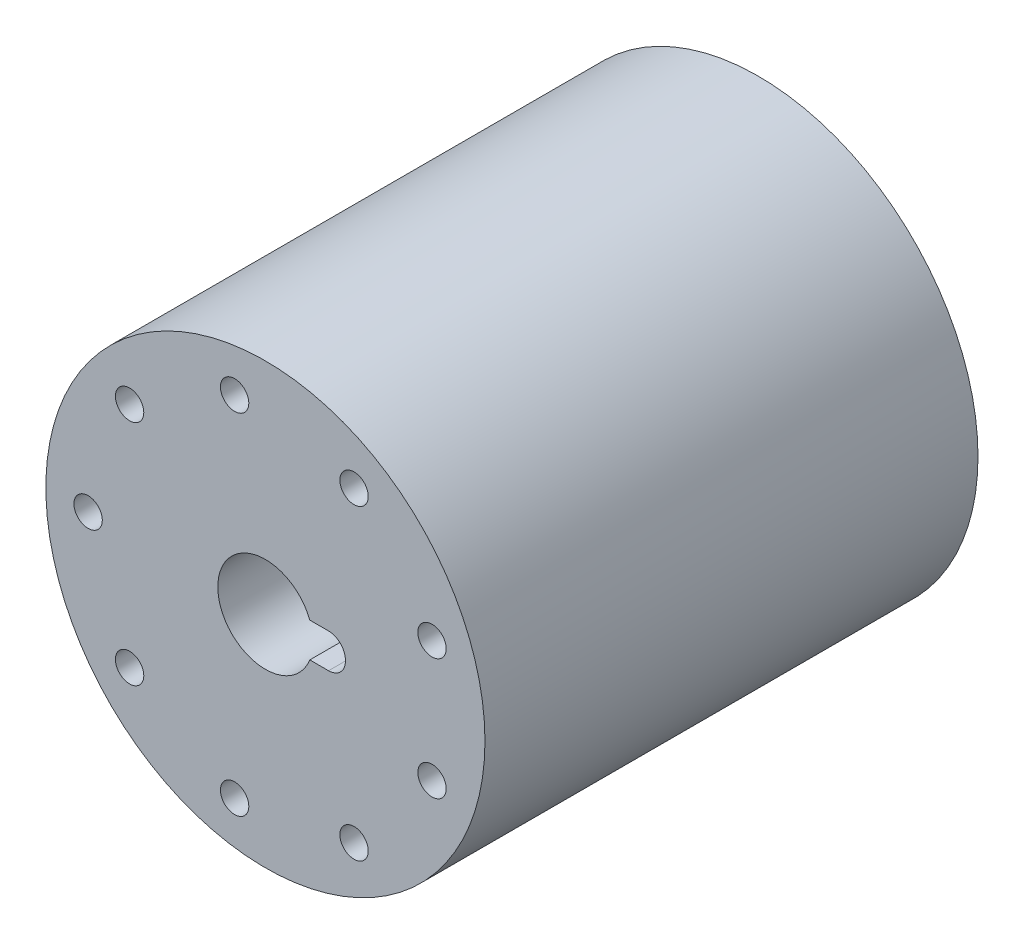
ISO-10303-21;
HEADER;
FILE_DESCRIPTION(('STEP AP214'),'2;1');
FILE_NAME('part.step','',(''),(''),'','','');
FILE_SCHEMA(('AUTOMOTIVE_DESIGN { 1 0 10303 214 1 1 1 1 }'));
ENDSEC;
DATA;
#1=APPLICATION_CONTEXT('core data for automotive mechanical design processes');
#2=APPLICATION_PROTOCOL_DEFINITION('international standard','automotive_design',2000,#1);
#3=PRODUCT_CONTEXT('',#1,'mechanical');
#4=PRODUCT('Part','Part','',(#3));
#5=PRODUCT_RELATED_PRODUCT_CATEGORY('part','',(#4));
#6=PRODUCT_DEFINITION_FORMATION('','',#4);
#7=PRODUCT_DEFINITION_CONTEXT('part definition',#1,'design');
#8=PRODUCT_DEFINITION('design','',#6,#7);
#9=PRODUCT_DEFINITION_SHAPE('','',#8);
#10=(LENGTH_UNIT() NAMED_UNIT(*) SI_UNIT(.MILLI.,.METRE.));
#11=(NAMED_UNIT(*) PLANE_ANGLE_UNIT() SI_UNIT($,.RADIAN.));
#12=(NAMED_UNIT(*) SI_UNIT($,.STERADIAN.) SOLID_ANGLE_UNIT());
#13=UNCERTAINTY_MEASURE_WITH_UNIT(LENGTH_MEASURE(1.E-05),#10,'distance_accuracy_value','');
#14=(GEOMETRIC_REPRESENTATION_CONTEXT(3) GLOBAL_UNCERTAINTY_ASSIGNED_CONTEXT((#13)) GLOBAL_UNIT_ASSIGNED_CONTEXT((#10,
#11,#12)) REPRESENTATION_CONTEXT('',''));
#15=CARTESIAN_POINT('',(0.,0.,0.));
#16=DIRECTION('',(0.,0.,1.));
#17=DIRECTION('',(1.,0.,0.));
#18=AXIS2_PLACEMENT_3D('',#15,#16,#17);
#19=CARTESIAN_POINT('',(0.,0.,26.5));
#20=DIRECTION('',(0.,0.,1.));
#21=DIRECTION('',(1.,0.,0.));
#22=AXIS2_PLACEMENT_3D('',#19,#20,#21);
#23=PLANE('',#22);
#24=DIRECTION('',(-1.,0.,0.));
#25=VECTOR('',#24,1.);
#26=CARTESIAN_POINT('',(7.961335345031,2.55,26.5));
#27=LINE('',#26,#25);
#28=CARTESIAN_POINT('',(9.35,2.55,26.5));
#29=VERTEX_POINT('',#28);
#30=CARTESIAN_POINT('',(6.572670690062,2.55,26.5));
#31=VERTEX_POINT('',#30);
#32=EDGE_CURVE('E247',#29,#31,#27,.T.);
#33=ORIENTED_EDGE('',*,*,#32,.T.);
#34=CARTESIAN_POINT('',(0.,0.,26.5));
#35=DIRECTION('',(0.,0.,1.));
#36=DIRECTION('',(1.,0.,0.));
#37=AXIS2_PLACEMENT_3D('',#34,#35,#36);
#38=CIRCLE('',#37,7.05);
#39=CARTESIAN_POINT('',(6.572670690062,-2.55,26.5));
#40=VERTEX_POINT('',#39);
#41=EDGE_CURVE('E234',#31,#40,#38,.T.);
#42=ORIENTED_EDGE('',*,*,#41,.T.);
#43=DIRECTION('',(-1.,0.,0.));
#44=VECTOR('',#43,1.);
#45=CARTESIAN_POINT('',(7.961335345031,-2.55,26.5));
#46=LINE('',#45,#44);
#47=CARTESIAN_POINT('',(9.35,-2.55,26.5));
#48=VERTEX_POINT('',#47);
#49=EDGE_CURVE('E382',#48,#40,#46,.T.);
#50=ORIENTED_EDGE('',*,*,#49,.F.);
#51=CARTESIAN_POINT('',(9.35,-0.0499999999999974,26.5));
#52=DIRECTION('',(0.,0.,-1.));
#53=DIRECTION('',(1.,0.,0.));
#54=AXIS2_PLACEMENT_3D('',#51,#52,#53);
#55=CIRCLE('',#54,2.5);
#56=CARTESIAN_POINT('',(11.85,-0.0499999999999945,26.5));
#57=VERTEX_POINT('',#56);
#58=EDGE_CURVE('E293',#57,#48,#55,.T.);
#59=ORIENTED_EDGE('',*,*,#58,.F.);
#60=DIRECTION('',(0.,1.,0.));
#61=VECTOR('',#60,1.);
#62=CARTESIAN_POINT('',(11.85,-0.0249999999999973,26.5));
#63=LINE('',#62,#61);
#64=CARTESIAN_POINT('',(11.85,0.0499999999999944,26.5));
#65=VERTEX_POINT('',#64);
#66=EDGE_CURVE('E27',#57,#65,#63,.T.);
#67=ORIENTED_EDGE('',*,*,#66,.T.);
#68=CARTESIAN_POINT('',(9.35,0.0499999999999974,26.5));
#69=DIRECTION('',(0.,0.,1.));
#70=DIRECTION('',(1.,0.,0.));
#71=AXIS2_PLACEMENT_3D('',#68,#69,#70);
#72=CIRCLE('',#71,2.5);
#73=EDGE_CURVE('E11',#65,#29,#72,.T.);
#74=ORIENTED_EDGE('',*,*,#73,.T.);
#75=EDGE_LOOP('',(#33,#42,#50,#59,#67,#74));
#76=FACE_BOUND('',#75,.T.);
#77=ADVANCED_FACE('F16',(#76),#23,.T.);
#78=CARTESIAN_POINT('',(9.35,0.0499999999999974,26.5));
#79=DIRECTION('',(0.,0.,1.));
#80=DIRECTION('',(1.,0.,0.));
#81=AXIS2_PLACEMENT_3D('',#78,#79,#80);
#82=CYLINDRICAL_SURFACE('',#81,2.5);
#83=CARTESIAN_POINT('',(9.35,0.0499999999999974,36.5));
#84=DIRECTION('',(0.,0.,1.));
#85=DIRECTION('',(1.,0.,0.));
#86=AXIS2_PLACEMENT_3D('',#83,#84,#85);
#87=CIRCLE('',#86,2.5);
#88=CARTESIAN_POINT('',(11.85,0.0499999999999974,36.5));
#89=VERTEX_POINT('',#88);
#90=CARTESIAN_POINT('',(9.35,2.55,36.5));
#91=VERTEX_POINT('',#90);
#92=EDGE_CURVE('E303',#89,#91,#87,.T.);
#93=ORIENTED_EDGE('',*,*,#92,.T.);
#94=DIRECTION('',(0.,0.,1.));
#95=VECTOR('',#94,1.);
#96=CARTESIAN_POINT('',(9.35,2.55,26.5));
#97=LINE('',#96,#95);
#98=EDGE_CURVE('E250',#29,#91,#97,.T.);
#99=ORIENTED_EDGE('',*,*,#98,.F.);
#100=ORIENTED_EDGE('',*,*,#73,.F.);
#101=DIRECTION('',(0.,0.,1.));
#102=VECTOR('',#101,1.);
#103=CARTESIAN_POINT('',(11.85,0.0499999999999944,26.5));
#104=LINE('',#103,#102);
#105=EDGE_CURVE('E291',#65,#89,#104,.T.);
#106=ORIENTED_EDGE('',*,*,#105,.T.);
#107=EDGE_LOOP('',(#93,#99,#100,#106));
#108=FACE_BOUND('',#107,.T.);
#109=ADVANCED_FACE('F425',(#108),#82,.F.);
#110=CARTESIAN_POINT('',(11.85,-0.0249999999999973,26.5));
#111=DIRECTION('',(1.,0.,0.));
#112=DIRECTION('',(0.,1.,0.));
#113=AXIS2_PLACEMENT_3D('',#110,#111,#112);
#114=PLANE('',#113);
#115=DIRECTION('',(0.,1.,0.));
#116=VECTOR('',#115,1.);
#117=CARTESIAN_POINT('',(11.85,-0.0249999999999973,36.5));
#118=LINE('',#117,#116);
#119=CARTESIAN_POINT('',(11.85,-0.0499999999999945,36.5));
#120=VERTEX_POINT('',#119);
#121=EDGE_CURVE('E307',#120,#89,#118,.T.);
#122=ORIENTED_EDGE('',*,*,#121,.T.);
#123=ORIENTED_EDGE('',*,*,#105,.F.);
#124=ORIENTED_EDGE('',*,*,#66,.F.);
#125=DIRECTION('',(0.,0.,1.));
#126=VECTOR('',#125,1.);
#127=CARTESIAN_POINT('',(11.85,-0.0499999999999945,26.5));
#128=LINE('',#127,#126);
#129=EDGE_CURVE('E354',#57,#120,#128,.T.);
#130=ORIENTED_EDGE('',*,*,#129,.T.);
#131=EDGE_LOOP('',(#122,#123,#124,#130));
#132=FACE_BOUND('',#131,.T.);
#133=ADVANCED_FACE('F423',(#132),#114,.F.);
#134=CARTESIAN_POINT('',(9.35,-0.0499999999999974,26.5));
#135=DIRECTION('',(0.,0.,1.));
#136=DIRECTION('',(1.,0.,0.));
#137=AXIS2_PLACEMENT_3D('',#134,#135,#136);
#138=CYLINDRICAL_SURFACE('',#137,2.5);
#139=CARTESIAN_POINT('',(9.35,-0.0499999999999974,36.5));
#140=DIRECTION('',(0.,0.,-1.));
#141=DIRECTION('',(1.,0.,0.));
#142=AXIS2_PLACEMENT_3D('',#139,#140,#141);
#143=CIRCLE('',#142,2.5);
#144=CARTESIAN_POINT('',(9.35,-2.55,36.5));
#145=VERTEX_POINT('',#144);
#146=EDGE_CURVE('E316',#120,#145,#143,.T.);
#147=ORIENTED_EDGE('',*,*,#146,.F.);
#148=ORIENTED_EDGE('',*,*,#129,.F.);
#149=ORIENTED_EDGE('',*,*,#58,.T.);
#150=DIRECTION('',(0.,0.,1.));
#151=VECTOR('',#150,1.);
#152=CARTESIAN_POINT('',(9.35,-2.55,26.5));
#153=LINE('',#152,#151);
#154=EDGE_CURVE('E244',#48,#145,#153,.T.);
#155=ORIENTED_EDGE('',*,*,#154,.T.);
#156=EDGE_LOOP('',(#147,#148,#149,#155));
#157=FACE_BOUND('',#156,.T.);
#158=ADVANCED_FACE('F419',(#157),#138,.F.);
#159=CARTESIAN_POINT('',(7.961335345031,-2.55,26.5));
#160=DIRECTION('',(0.,1.,0.));
#161=DIRECTION('',(1.,0.,0.));
#162=AXIS2_PLACEMENT_3D('',#159,#160,#161);
#163=PLANE('',#162);
#164=DIRECTION('',(-1.,0.,0.));
#165=VECTOR('',#164,1.);
#166=CARTESIAN_POINT('',(7.961335345031,-2.55,36.5));
#167=LINE('',#166,#165);
#168=CARTESIAN_POINT('',(6.572670690062,-2.55,36.5));
#169=VERTEX_POINT('',#168);
#170=EDGE_CURVE('E302',#145,#169,#167,.T.);
#171=ORIENTED_EDGE('',*,*,#170,.F.);
#172=ORIENTED_EDGE('',*,*,#154,.F.);
#173=ORIENTED_EDGE('',*,*,#49,.T.);
#174=DIRECTION('',(0.,0.,1.));
#175=VECTOR('',#174,1.);
#176=CARTESIAN_POINT('',(6.572670690062,-2.55,26.5));
#177=LINE('',#176,#175);
#178=EDGE_CURVE('E240',#40,#169,#177,.T.);
#179=ORIENTED_EDGE('',*,*,#178,.T.);
#180=EDGE_LOOP('',(#171,#172,#173,#179));
#181=FACE_BOUND('',#180,.T.);
#182=ADVANCED_FACE('F413',(#181),#163,.T.);
#183=CARTESIAN_POINT('',(0.,0.,26.5));
#184=DIRECTION('',(0.,0.,1.));
#185=DIRECTION('',(1.,0.,0.));
#186=AXIS2_PLACEMENT_3D('',#183,#184,#185);
#187=CYLINDRICAL_SURFACE('',#186,7.05);
#188=CARTESIAN_POINT('',(0.,0.,36.5));
#189=DIRECTION('',(0.,0.,1.));
#190=DIRECTION('',(1.,0.,0.));
#191=AXIS2_PLACEMENT_3D('',#188,#189,#190);
#192=CIRCLE('',#191,7.05);
#193=CARTESIAN_POINT('',(6.572670690062,2.55,36.5));
#194=VERTEX_POINT('',#193);
#195=EDGE_CURVE('E299',#194,#169,#192,.T.);
#196=ORIENTED_EDGE('',*,*,#195,.T.);
#197=ORIENTED_EDGE('',*,*,#178,.F.);
#198=ORIENTED_EDGE('',*,*,#41,.F.);
#199=DIRECTION('',(0.,0.,1.));
#200=VECTOR('',#199,1.);
#201=CARTESIAN_POINT('',(6.572670690062,2.55,26.5));
#202=LINE('',#201,#200);
#203=EDGE_CURVE('E20',#31,#194,#202,.T.);
#204=ORIENTED_EDGE('',*,*,#203,.T.);
#205=EDGE_LOOP('',(#196,#197,#198,#204));
#206=FACE_BOUND('',#205,.T.);
#207=ADVANCED_FACE('F237',(#206),#187,.F.);
#208=CARTESIAN_POINT('',(7.961335345031,2.55,26.5));
#209=DIRECTION('',(0.,1.,0.));
#210=DIRECTION('',(1.,0.,0.));
#211=AXIS2_PLACEMENT_3D('',#208,#209,#210);
#212=PLANE('',#211);
#213=DIRECTION('',(-1.,0.,0.));
#214=VECTOR('',#213,1.);
#215=CARTESIAN_POINT('',(7.961335345031,2.55,36.5));
#216=LINE('',#215,#214);
#217=EDGE_CURVE('E255',#91,#194,#216,.T.);
#218=ORIENTED_EDGE('',*,*,#217,.T.);
#219=ORIENTED_EDGE('',*,*,#203,.F.);
#220=ORIENTED_EDGE('',*,*,#32,.F.);
#221=ORIENTED_EDGE('',*,*,#98,.T.);
#222=EDGE_LOOP('',(#218,#219,#220,#221));
#223=FACE_BOUND('',#222,.T.);
#224=ADVANCED_FACE('F253',(#223),#212,.F.);
#225=CARTESIAN_POINT('',(0.,0.,-16.5));
#226=DIRECTION('',(0.,0.,1.));
#227=DIRECTION('',(1.,0.,0.));
#228=AXIS2_PLACEMENT_3D('',#225,#226,#227);
#229=PLANE('',#228);
#230=CARTESIAN_POINT('',(-26.25,0.,-16.5));
#231=DIRECTION('',(0.,0.,1.));
#232=DIRECTION('',(1.,0.,0.));
#233=AXIS2_PLACEMENT_3D('',#230,#231,#232);
#234=CIRCLE('',#233,2.1);
#235=CARTESIAN_POINT('',(-24.15,0.,-16.5));
#236=VERTEX_POINT('',#235);
#237=EDGE_CURVE('E257',#236,#236,#234,.T.);
#238=ORIENTED_EDGE('',*,*,#237,.F.);
#239=EDGE_LOOP('',(#238));
#240=FACE_BOUND('',#239,.T.);
#241=ADVANCED_FACE('F467',(#240),#229,.F.);
#242=CARTESIAN_POINT('',(-26.25,0.,-16.5));
#243=DIRECTION('',(0.,0.,-1.));
#244=DIRECTION('',(-1.,0.,0.));
#245=AXIS2_PLACEMENT_3D('',#242,#243,#244);
#246=CYLINDRICAL_SURFACE('',#245,2.1);
#247=CARTESIAN_POINT('',(-26.25,0.,-36.5));
#248=DIRECTION('',(0.,0.,1.));
#249=DIRECTION('',(1.,0.,0.));
#250=AXIS2_PLACEMENT_3D('',#247,#248,#249);
#251=CIRCLE('',#250,2.1);
#252=CARTESIAN_POINT('',(-24.15,0.,-36.5));
#253=VERTEX_POINT('',#252);
#254=EDGE_CURVE('E294',#253,#253,#251,.T.);
#255=ORIENTED_EDGE('',*,*,#254,.F.);
#256=EDGE_LOOP('',(#255));
#257=FACE_BOUND('',#256,.T.);
#258=ORIENTED_EDGE('',*,*,#237,.T.);
#259=EDGE_LOOP('',(#258));
#260=FACE_BOUND('',#259,.T.);
#261=ADVANCED_FACE('F470',(#257,#260),#246,.F.);
#262=CARTESIAN_POINT('',(0.,0.,-16.5));
#263=DIRECTION('',(0.,0.,1.));
#264=DIRECTION('',(1.,0.,0.));
#265=AXIS2_PLACEMENT_3D('',#262,#263,#264);
#266=PLANE('',#265);
#267=CARTESIAN_POINT('',(13.125,22.7331668493415,-16.5));
#268=DIRECTION('',(0.,0.,1.));
#269=DIRECTION('',(1.,0.,0.));
#270=AXIS2_PLACEMENT_3D('',#267,#268,#269);
#271=CIRCLE('',#270,2.1);
#272=CARTESIAN_POINT('',(15.225,22.7331668493415,-16.5));
#273=VERTEX_POINT('',#272);
#274=EDGE_CURVE('E263',#273,#273,#271,.T.);
#275=ORIENTED_EDGE('',*,*,#274,.F.);
#276=EDGE_LOOP('',(#275));
#277=FACE_BOUND('',#276,.T.);
#278=ADVANCED_FACE('F524',(#277),#266,.F.);
#279=CARTESIAN_POINT('',(13.125,22.7331668493415,-16.5));
#280=DIRECTION('',(0.,0.,-1.));
#281=DIRECTION('',(-1.,0.,0.));
#282=AXIS2_PLACEMENT_3D('',#279,#280,#281);
#283=CYLINDRICAL_SURFACE('',#282,2.1);
#284=CARTESIAN_POINT('',(13.125,22.7331668493415,-36.5));
#285=DIRECTION('',(0.,0.,1.));
#286=DIRECTION('',(1.,0.,0.));
#287=AXIS2_PLACEMENT_3D('',#284,#285,#286);
#288=CIRCLE('',#287,2.1);
#289=CARTESIAN_POINT('',(15.225,22.7331668493415,-36.5));
#290=VERTEX_POINT('',#289);
#291=EDGE_CURVE('E297',#290,#290,#288,.T.);
#292=ORIENTED_EDGE('',*,*,#291,.F.);
#293=EDGE_LOOP('',(#292));
#294=FACE_BOUND('',#293,.T.);
#295=ORIENTED_EDGE('',*,*,#274,.T.);
#296=EDGE_LOOP('',(#295));
#297=FACE_BOUND('',#296,.T.);
#298=ADVANCED_FACE('F520',(#294,#297),#283,.F.);
#299=CARTESIAN_POINT('',(0.,0.,-16.5));
#300=DIRECTION('',(0.,0.,1.));
#301=DIRECTION('',(1.,0.,0.));
#302=AXIS2_PLACEMENT_3D('',#299,#300,#301);
#303=PLANE('',#302);
#304=CARTESIAN_POINT('',(24.6669312956301,8.97802876229881,-16.5));
#305=DIRECTION('',(0.,0.,1.));
#306=DIRECTION('',(1.,0.,0.));
#307=AXIS2_PLACEMENT_3D('',#304,#305,#306);
#308=CIRCLE('',#307,2.1);
#309=CARTESIAN_POINT('',(26.7669312956301,8.97802876229881,-16.5));
#310=VERTEX_POINT('',#309);
#311=EDGE_CURVE('E271',#310,#310,#308,.T.);
#312=ORIENTED_EDGE('',*,*,#311,.F.);
#313=EDGE_LOOP('',(#312));
#314=FACE_BOUND('',#313,.T.);
#315=ADVANCED_FACE('F523',(#314),#303,.F.);
#316=CARTESIAN_POINT('',(24.6669312956301,8.97802876229881,-16.5));
#317=DIRECTION('',(0.,0.,-1.));
#318=DIRECTION('',(-1.,0.,0.));
#319=AXIS2_PLACEMENT_3D('',#316,#317,#318);
#320=CYLINDRICAL_SURFACE('',#319,2.1);
#321=CARTESIAN_POINT('',(24.6669312956301,8.97802876229881,-36.5));
#322=DIRECTION('',(0.,0.,1.));
#323=DIRECTION('',(1.,0.,0.));
#324=AXIS2_PLACEMENT_3D('',#321,#322,#323);
#325=CIRCLE('',#324,2.1);
#326=CARTESIAN_POINT('',(26.7669312956301,8.97802876229881,-36.5));
#327=VERTEX_POINT('',#326);
#328=EDGE_CURVE('E379',#327,#327,#325,.T.);
#329=ORIENTED_EDGE('',*,*,#328,.F.);
#330=EDGE_LOOP('',(#329));
#331=FACE_BOUND('',#330,.T.);
#332=ORIENTED_EDGE('',*,*,#311,.T.);
#333=EDGE_LOOP('',(#332));
#334=FACE_BOUND('',#333,.T.);
#335=ADVANCED_FACE('F509',(#331,#334),#320,.F.);
#336=CARTESIAN_POINT('',(0.,0.,-16.5));
#337=DIRECTION('',(0.,0.,1.));
#338=DIRECTION('',(1.,0.,0.));
#339=AXIS2_PLACEMENT_3D('',#336,#337,#338);
#340=PLANE('',#339);
#341=CARTESIAN_POINT('',(24.6669312956301,-8.97802876229881,-16.5));
#342=DIRECTION('',(0.,0.,1.));
#343=DIRECTION('',(1.,0.,0.));
#344=AXIS2_PLACEMENT_3D('',#341,#342,#343);
#345=CIRCLE('',#344,2.1);
#346=CARTESIAN_POINT('',(26.7669312956301,-8.97802876229881,-16.5));
#347=VERTEX_POINT('',#346);
#348=EDGE_CURVE('E311',#347,#347,#345,.T.);
#349=ORIENTED_EDGE('',*,*,#348,.F.);
#350=EDGE_LOOP('',(#349));
#351=FACE_BOUND('',#350,.T.);
#352=ADVANCED_FACE('F506',(#351),#340,.F.);
#353=CARTESIAN_POINT('',(24.6669312956301,-8.97802876229881,-16.5));
#354=DIRECTION('',(0.,0.,-1.));
#355=DIRECTION('',(-1.,0.,0.));
#356=AXIS2_PLACEMENT_3D('',#353,#354,#355);
#357=CYLINDRICAL_SURFACE('',#356,2.1);
#358=CARTESIAN_POINT('',(24.6669312956301,-8.97802876229881,-36.5));
#359=DIRECTION('',(0.,0.,1.));
#360=DIRECTION('',(1.,0.,0.));
#361=AXIS2_PLACEMENT_3D('',#358,#359,#360);
#362=CIRCLE('',#361,2.1);
#363=CARTESIAN_POINT('',(26.7669312956301,-8.97802876229881,-36.5));
#364=VERTEX_POINT('',#363);
#365=EDGE_CURVE('E374',#364,#364,#362,.T.);
#366=ORIENTED_EDGE('',*,*,#365,.F.);
#367=EDGE_LOOP('',(#366));
#368=FACE_BOUND('',#367,.T.);
#369=ORIENTED_EDGE('',*,*,#348,.T.);
#370=EDGE_LOOP('',(#369));
#371=FACE_BOUND('',#370,.T.);
#372=ADVANCED_FACE('F508',(#368,#371),#357,.F.);
#373=CARTESIAN_POINT('',(0.,0.,-16.5));
#374=DIRECTION('',(0.,0.,1.));
#375=DIRECTION('',(1.,0.,0.));
#376=AXIS2_PLACEMENT_3D('',#373,#374,#375);
#377=PLANE('',#376);
#378=CARTESIAN_POINT('',(13.125,-22.7331668493415,-16.5));
#379=DIRECTION('',(0.,0.,1.));
#380=DIRECTION('',(1.,0.,0.));
#381=AXIS2_PLACEMENT_3D('',#378,#379,#380);
#382=CIRCLE('',#381,2.1);
#383=CARTESIAN_POINT('',(15.225,-22.7331668493415,-16.5));
#384=VERTEX_POINT('',#383);
#385=EDGE_CURVE('E308',#384,#384,#382,.T.);
#386=ORIENTED_EDGE('',*,*,#385,.F.);
#387=EDGE_LOOP('',(#386));
#388=FACE_BOUND('',#387,.T.);
#389=ADVANCED_FACE('F535',(#388),#377,.F.);
#390=CARTESIAN_POINT('',(13.125,-22.7331668493415,-16.5));
#391=DIRECTION('',(0.,0.,-1.));
#392=DIRECTION('',(-1.,0.,0.));
#393=AXIS2_PLACEMENT_3D('',#390,#391,#392);
#394=CYLINDRICAL_SURFACE('',#393,2.1);
#395=CARTESIAN_POINT('',(13.125,-22.7331668493415,-36.5));
#396=DIRECTION('',(0.,0.,1.));
#397=DIRECTION('',(1.,0.,0.));
#398=AXIS2_PLACEMENT_3D('',#395,#396,#397);
#399=CIRCLE('',#398,2.1);
#400=CARTESIAN_POINT('',(15.225,-22.7331668493415,-36.5));
#401=VERTEX_POINT('',#400);
#402=EDGE_CURVE('E352',#401,#401,#399,.T.);
#403=ORIENTED_EDGE('',*,*,#402,.F.);
#404=EDGE_LOOP('',(#403));
#405=FACE_BOUND('',#404,.T.);
#406=ORIENTED_EDGE('',*,*,#385,.T.);
#407=EDGE_LOOP('',(#406));
#408=FACE_BOUND('',#407,.T.);
#409=ADVANCED_FACE('F500',(#405,#408),#394,.F.);
#410=CARTESIAN_POINT('',(0.,0.,-16.5));
#411=DIRECTION('',(0.,0.,1.));
#412=DIRECTION('',(1.,0.,0.));
#413=AXIS2_PLACEMENT_3D('',#410,#411,#412);
#414=PLANE('',#413);
#415=CARTESIAN_POINT('',(-4.55826466375692,-25.8512035165704,-16.5));
#416=DIRECTION('',(0.,0.,1.));
#417=DIRECTION('',(1.,0.,0.));
#418=AXIS2_PLACEMENT_3D('',#415,#416,#417);
#419=CIRCLE('',#418,2.1);
#420=CARTESIAN_POINT('',(-2.45826466375692,-25.8512035165704,-16.5));
#421=VERTEX_POINT('',#420);
#422=EDGE_CURVE('E312',#421,#421,#419,.T.);
#423=ORIENTED_EDGE('',*,*,#422,.F.);
#424=EDGE_LOOP('',(#423));
#425=FACE_BOUND('',#424,.T.);
#426=ADVANCED_FACE('F463',(#425),#414,.F.);
#427=CARTESIAN_POINT('',(-4.55826466375692,-25.8512035165704,-16.5));
#428=DIRECTION('',(0.,0.,-1.));
#429=DIRECTION('',(-1.,0.,0.));
#430=AXIS2_PLACEMENT_3D('',#427,#428,#429);
#431=CYLINDRICAL_SURFACE('',#430,2.1);
#432=CARTESIAN_POINT('',(-4.55826466375692,-25.8512035165704,-36.5));
#433=DIRECTION('',(0.,0.,1.));
#434=DIRECTION('',(1.,0.,0.));
#435=AXIS2_PLACEMENT_3D('',#432,#433,#434);
#436=CIRCLE('',#435,2.1);
#437=CARTESIAN_POINT('',(-2.45826466375692,-25.8512035165704,-36.5));
#438=VERTEX_POINT('',#437);
#439=EDGE_CURVE('E341',#438,#438,#436,.T.);
#440=ORIENTED_EDGE('',*,*,#439,.F.);
#441=EDGE_LOOP('',(#440));
#442=FACE_BOUND('',#441,.T.);
#443=ORIENTED_EDGE('',*,*,#422,.T.);
#444=EDGE_LOOP('',(#443));
#445=FACE_BOUND('',#444,.T.);
#446=ADVANCED_FACE('F459',(#442,#445),#431,.F.);
#447=CARTESIAN_POINT('',(0.,0.,-16.5));
#448=DIRECTION('',(0.,0.,1.));
#449=DIRECTION('',(1.,0.,0.));
#450=AXIS2_PLACEMENT_3D('',#447,#448,#449);
#451=PLANE('',#450);
#452=CARTESIAN_POINT('',(-20.1086666318732,-16.8731747542716,-16.5));
#453=DIRECTION('',(0.,0.,1.));
#454=DIRECTION('',(1.,0.,0.));
#455=AXIS2_PLACEMENT_3D('',#452,#453,#454);
#456=CIRCLE('',#455,2.1);
#457=CARTESIAN_POINT('',(-18.0086666318732,-16.8731747542716,-16.5));
#458=VERTEX_POINT('',#457);
#459=EDGE_CURVE('E280',#458,#458,#456,.T.);
#460=ORIENTED_EDGE('',*,*,#459,.F.);
#461=EDGE_LOOP('',(#460));
#462=FACE_BOUND('',#461,.T.);
#463=ADVANCED_FACE('F462',(#462),#451,.F.);
#464=CARTESIAN_POINT('',(-20.1086666318732,-16.8731747542716,-16.5));
#465=DIRECTION('',(0.,0.,-1.));
#466=DIRECTION('',(-1.,0.,0.));
#467=AXIS2_PLACEMENT_3D('',#464,#465,#466);
#468=CYLINDRICAL_SURFACE('',#467,2.1);
#469=CARTESIAN_POINT('',(-20.1086666318732,-16.8731747542716,-36.5));
#470=DIRECTION('',(0.,0.,1.));
#471=DIRECTION('',(1.,0.,0.));
#472=AXIS2_PLACEMENT_3D('',#469,#470,#471);
#473=CIRCLE('',#472,2.1);
#474=CARTESIAN_POINT('',(-18.0086666318732,-16.8731747542716,-36.5));
#475=VERTEX_POINT('',#474);
#476=EDGE_CURVE('E337',#475,#475,#473,.T.);
#477=ORIENTED_EDGE('',*,*,#476,.F.);
#478=EDGE_LOOP('',(#477));
#479=FACE_BOUND('',#478,.T.);
#480=ORIENTED_EDGE('',*,*,#459,.T.);
#481=EDGE_LOOP('',(#480));
#482=FACE_BOUND('',#481,.T.);
#483=ADVANCED_FACE('F496',(#479,#482),#468,.F.);
#484=CARTESIAN_POINT('',(0.,0.,-16.5));
#485=DIRECTION('',(0.,0.,1.));
#486=DIRECTION('',(1.,0.,0.));
#487=AXIS2_PLACEMENT_3D('',#484,#485,#486);
#488=PLANE('',#487);
#489=CARTESIAN_POINT('',(-20.1086666318732,16.8731747542716,-16.5));
#490=DIRECTION('',(0.,0.,1.));
#491=DIRECTION('',(1.,0.,0.));
#492=AXIS2_PLACEMENT_3D('',#489,#490,#491);
#493=CIRCLE('',#492,2.1);
#494=CARTESIAN_POINT('',(-18.0086666318732,16.8731747542716,-16.5));
#495=VERTEX_POINT('',#494);
#496=EDGE_CURVE('E277',#495,#495,#493,.T.);
#497=ORIENTED_EDGE('',*,*,#496,.F.);
#498=EDGE_LOOP('',(#497));
#499=FACE_BOUND('',#498,.T.);
#500=ADVANCED_FACE('F458',(#499),#488,.F.);
#501=CARTESIAN_POINT('',(-20.1086666318732,16.8731747542716,-16.5));
#502=DIRECTION('',(0.,0.,-1.));
#503=DIRECTION('',(-1.,0.,0.));
#504=AXIS2_PLACEMENT_3D('',#501,#502,#503);
#505=CYLINDRICAL_SURFACE('',#504,2.1);
#506=CARTESIAN_POINT('',(-20.1086666318732,16.8731747542716,-36.5));
#507=DIRECTION('',(0.,0.,1.));
#508=DIRECTION('',(1.,0.,0.));
#509=AXIS2_PLACEMENT_3D('',#506,#507,#508);
#510=CIRCLE('',#509,2.1);
#511=CARTESIAN_POINT('',(-18.0086666318732,16.8731747542716,-36.5));
#512=VERTEX_POINT('',#511);
#513=EDGE_CURVE('E340',#512,#512,#510,.T.);
#514=ORIENTED_EDGE('',*,*,#513,.F.);
#515=EDGE_LOOP('',(#514));
#516=FACE_BOUND('',#515,.T.);
#517=ORIENTED_EDGE('',*,*,#496,.T.);
#518=EDGE_LOOP('',(#517));
#519=FACE_BOUND('',#518,.T.);
#520=ADVANCED_FACE('F551',(#516,#519),#505,.F.);
#521=CARTESIAN_POINT('',(0.,0.,-16.5));
#522=DIRECTION('',(0.,0.,1.));
#523=DIRECTION('',(1.,0.,0.));
#524=AXIS2_PLACEMENT_3D('',#521,#522,#523);
#525=PLANE('',#524);
#526=CARTESIAN_POINT('',(-4.55826466375691,25.8512035165704,-16.5));
#527=DIRECTION('',(0.,0.,1.));
#528=DIRECTION('',(1.,0.,0.));
#529=AXIS2_PLACEMENT_3D('',#526,#527,#528);
#530=CIRCLE('',#529,2.1);
#531=CARTESIAN_POINT('',(-2.45826466375691,25.8512035165704,-16.5));
#532=VERTEX_POINT('',#531);
#533=EDGE_CURVE('E281',#532,#532,#530,.T.);
#534=ORIENTED_EDGE('',*,*,#533,.F.);
#535=EDGE_LOOP('',(#534));
#536=FACE_BOUND('',#535,.T.);
#537=ADVANCED_FACE('F544',(#536),#525,.F.);
#538=CARTESIAN_POINT('',(-4.55826466375691,25.8512035165704,-16.5));
#539=DIRECTION('',(0.,0.,-1.));
#540=DIRECTION('',(-1.,0.,0.));
#541=AXIS2_PLACEMENT_3D('',#538,#539,#540);
#542=CYLINDRICAL_SURFACE('',#541,2.1);
#543=CARTESIAN_POINT('',(-4.55826466375691,25.8512035165704,-36.5));
#544=DIRECTION('',(0.,0.,1.));
#545=DIRECTION('',(1.,0.,0.));
#546=AXIS2_PLACEMENT_3D('',#543,#544,#545);
#547=CIRCLE('',#546,2.1);
#548=CARTESIAN_POINT('',(-2.45826466375691,25.8512035165704,-36.5));
#549=VERTEX_POINT('',#548);
#550=EDGE_CURVE('E362',#549,#549,#547,.T.);
#551=ORIENTED_EDGE('',*,*,#550,.F.);
#552=EDGE_LOOP('',(#551));
#553=FACE_BOUND('',#552,.T.);
#554=ORIENTED_EDGE('',*,*,#533,.T.);
#555=EDGE_LOOP('',(#554));
#556=FACE_BOUND('',#555,.T.);
#557=ADVANCED_FACE('F541',(#553,#556),#542,.F.);
#558=CARTESIAN_POINT('',(0.,0.,16.5));
#559=DIRECTION('',(0.,0.,1.));
#560=DIRECTION('',(1.,0.,0.));
#561=AXIS2_PLACEMENT_3D('',#558,#559,#560);
#562=PLANE('',#561);
#563=CARTESIAN_POINT('',(24.6669312956301,8.97802876229881,16.5));
#564=DIRECTION('',(0.,0.,1.));
#565=DIRECTION('',(1.,0.,0.));
#566=AXIS2_PLACEMENT_3D('',#563,#564,#565);
#567=CIRCLE('',#566,2.1);
#568=CARTESIAN_POINT('',(26.7669312956301,8.97802876229881,16.5));
#569=VERTEX_POINT('',#568);
#570=EDGE_CURVE('E319',#569,#569,#567,.T.);
#571=ORIENTED_EDGE('',*,*,#570,.T.);
#572=EDGE_LOOP('',(#571));
#573=FACE_BOUND('',#572,.T.);
#574=ADVANCED_FACE('F543',(#573),#562,.T.);
#575=CARTESIAN_POINT('',(24.6669312956301,8.97802876229881,16.5));
#576=DIRECTION('',(0.,0.,1.));
#577=DIRECTION('',(1.,0.,0.));
#578=AXIS2_PLACEMENT_3D('',#575,#576,#577);
#579=CYLINDRICAL_SURFACE('',#578,2.1);
#580=CARTESIAN_POINT('',(24.6669312956301,8.97802876229881,36.5));
#581=DIRECTION('',(0.,0.,1.));
#582=DIRECTION('',(1.,0.,0.));
#583=AXIS2_PLACEMENT_3D('',#580,#581,#582);
#584=CIRCLE('',#583,2.1);
#585=CARTESIAN_POINT('',(26.7669312956301,8.97802876229881,36.5));
#586=VERTEX_POINT('',#585);
#587=EDGE_CURVE('E286',#586,#586,#584,.T.);
#588=ORIENTED_EDGE('',*,*,#587,.T.);
#589=EDGE_LOOP('',(#588));
#590=FACE_BOUND('',#589,.T.);
#591=ORIENTED_EDGE('',*,*,#570,.F.);
#592=EDGE_LOOP('',(#591));
#593=FACE_BOUND('',#592,.T.);
#594=ADVANCED_FACE('F476',(#590,#593),#579,.F.);
#595=CARTESIAN_POINT('',(0.,0.,16.5));
#596=DIRECTION('',(0.,0.,1.));
#597=DIRECTION('',(1.,0.,0.));
#598=AXIS2_PLACEMENT_3D('',#595,#596,#597);
#599=PLANE('',#598);
#600=CARTESIAN_POINT('',(24.6669312956301,-8.97802876229881,16.5));
#601=DIRECTION('',(0.,0.,1.));
#602=DIRECTION('',(1.,0.,0.));
#603=AXIS2_PLACEMENT_3D('',#600,#601,#602);
#604=CIRCLE('',#603,2.1);
#605=CARTESIAN_POINT('',(26.7669312956301,-8.97802876229881,16.5));
#606=VERTEX_POINT('',#605);
#607=EDGE_CURVE('E322',#606,#606,#604,.T.);
#608=ORIENTED_EDGE('',*,*,#607,.T.);
#609=EDGE_LOOP('',(#608));
#610=FACE_BOUND('',#609,.T.);
#611=ADVANCED_FACE('F472',(#610),#599,.T.);
#612=CARTESIAN_POINT('',(24.6669312956301,-8.97802876229881,16.5));
#613=DIRECTION('',(0.,0.,1.));
#614=DIRECTION('',(1.,0.,0.));
#615=AXIS2_PLACEMENT_3D('',#612,#613,#614);
#616=CYLINDRICAL_SURFACE('',#615,2.1);
#617=CARTESIAN_POINT('',(24.6669312956301,-8.97802876229881,36.5));
#618=DIRECTION('',(0.,0.,1.));
#619=DIRECTION('',(1.,0.,0.));
#620=AXIS2_PLACEMENT_3D('',#617,#618,#619);
#621=CIRCLE('',#620,2.1);
#622=CARTESIAN_POINT('',(26.7669312956301,-8.97802876229881,36.5));
#623=VERTEX_POINT('',#622);
#624=EDGE_CURVE('E282',#623,#623,#621,.T.);
#625=ORIENTED_EDGE('',*,*,#624,.T.);
#626=EDGE_LOOP('',(#625));
#627=FACE_BOUND('',#626,.T.);
#628=ORIENTED_EDGE('',*,*,#607,.F.);
#629=EDGE_LOOP('',(#628));
#630=FACE_BOUND('',#629,.T.);
#631=ADVANCED_FACE('F475',(#627,#630),#616,.F.);
#632=CARTESIAN_POINT('',(0.,0.,16.5));
#633=DIRECTION('',(0.,0.,1.));
#634=DIRECTION('',(1.,0.,0.));
#635=AXIS2_PLACEMENT_3D('',#632,#633,#634);
#636=PLANE('',#635);
#637=CARTESIAN_POINT('',(13.125,-22.7331668493415,16.5));
#638=DIRECTION('',(0.,0.,1.));
#639=DIRECTION('',(1.,0.,0.));
#640=AXIS2_PLACEMENT_3D('',#637,#638,#639);
#641=CIRCLE('',#640,2.1);
#642=CARTESIAN_POINT('',(15.225,-22.7331668493415,16.5));
#643=VERTEX_POINT('',#642);
#644=EDGE_CURVE('E342',#643,#643,#641,.T.);
#645=ORIENTED_EDGE('',*,*,#644,.T.);
#646=EDGE_LOOP('',(#645));
#647=FACE_BOUND('',#646,.T.);
#648=ADVANCED_FACE('F492',(#647),#636,.T.);
#649=CARTESIAN_POINT('',(13.125,-22.7331668493415,16.5));
#650=DIRECTION('',(0.,0.,1.));
#651=DIRECTION('',(1.,0.,0.));
#652=AXIS2_PLACEMENT_3D('',#649,#650,#651);
#653=CYLINDRICAL_SURFACE('',#652,2.1);
#654=CARTESIAN_POINT('',(13.125,-22.7331668493415,36.5));
#655=DIRECTION('',(0.,0.,1.));
#656=DIRECTION('',(1.,0.,0.));
#657=AXIS2_PLACEMENT_3D('',#654,#655,#656);
#658=CIRCLE('',#657,2.1);
#659=CARTESIAN_POINT('',(15.225,-22.7331668493415,36.5));
#660=VERTEX_POINT('',#659);
#661=EDGE_CURVE('E285',#660,#660,#658,.T.);
#662=ORIENTED_EDGE('',*,*,#661,.T.);
#663=EDGE_LOOP('',(#662));
#664=FACE_BOUND('',#663,.T.);
#665=ORIENTED_EDGE('',*,*,#644,.F.);
#666=EDGE_LOOP('',(#665));
#667=FACE_BOUND('',#666,.T.);
#668=ADVANCED_FACE('F504',(#664,#667),#653,.F.);
#669=CARTESIAN_POINT('',(0.,0.,16.5));
#670=DIRECTION('',(0.,0.,1.));
#671=DIRECTION('',(1.,0.,0.));
#672=AXIS2_PLACEMENT_3D('',#669,#670,#671);
#673=PLANE('',#672);
#674=CARTESIAN_POINT('',(-4.55826466375692,-25.8512035165704,16.5));
#675=DIRECTION('',(0.,0.,1.));
#676=DIRECTION('',(1.,0.,0.));
#677=AXIS2_PLACEMENT_3D('',#674,#675,#676);
#678=CIRCLE('',#677,2.1);
#679=CARTESIAN_POINT('',(-2.45826466375692,-25.8512035165704,16.5));
#680=VERTEX_POINT('',#679);
#681=EDGE_CURVE('E275',#680,#680,#678,.T.);
#682=ORIENTED_EDGE('',*,*,#681,.T.);
#683=EDGE_LOOP('',(#682));
#684=FACE_BOUND('',#683,.T.);
#685=ADVANCED_FACE('F537',(#684),#673,.T.);
#686=CARTESIAN_POINT('',(-4.55826466375692,-25.8512035165704,16.5));
#687=DIRECTION('',(0.,0.,1.));
#688=DIRECTION('',(1.,0.,0.));
#689=AXIS2_PLACEMENT_3D('',#686,#687,#688);
#690=CYLINDRICAL_SURFACE('',#689,2.1);
#691=CARTESIAN_POINT('',(-4.55826466375692,-25.8512035165704,36.5));
#692=DIRECTION('',(0.,0.,1.));
#693=DIRECTION('',(1.,0.,0.));
#694=AXIS2_PLACEMENT_3D('',#691,#692,#693);
#695=CIRCLE('',#694,2.1);
#696=CARTESIAN_POINT('',(-2.45826466375692,-25.8512035165704,36.5));
#697=VERTEX_POINT('',#696);
#698=EDGE_CURVE('E333',#697,#697,#695,.T.);
#699=ORIENTED_EDGE('',*,*,#698,.T.);
#700=EDGE_LOOP('',(#699));
#701=FACE_BOUND('',#700,.T.);
#702=ORIENTED_EDGE('',*,*,#681,.F.);
#703=EDGE_LOOP('',(#702));
#704=FACE_BOUND('',#703,.T.);
#705=ADVANCED_FACE('F539',(#701,#704),#690,.F.);
#706=CARTESIAN_POINT('',(0.,0.,16.5));
#707=DIRECTION('',(0.,0.,1.));
#708=DIRECTION('',(1.,0.,0.));
#709=AXIS2_PLACEMENT_3D('',#706,#707,#708);
#710=PLANE('',#709);
#711=CARTESIAN_POINT('',(-20.1086666318732,-16.8731747542716,16.5));
#712=DIRECTION('',(0.,0.,1.));
#713=DIRECTION('',(1.,0.,0.));
#714=AXIS2_PLACEMENT_3D('',#711,#712,#713);
#715=CIRCLE('',#714,2.1);
#716=CARTESIAN_POINT('',(-18.0086666318732,-16.8731747542716,16.5));
#717=VERTEX_POINT('',#716);
#718=EDGE_CURVE('E365',#717,#717,#715,.T.);
#719=ORIENTED_EDGE('',*,*,#718,.T.);
#720=EDGE_LOOP('',(#719));
#721=FACE_BOUND('',#720,.T.);
#722=ADVANCED_FACE('F483',(#721),#710,.T.);
#723=CARTESIAN_POINT('',(-20.1086666318732,-16.8731747542716,16.5));
#724=DIRECTION('',(0.,0.,1.));
#725=DIRECTION('',(1.,0.,0.));
#726=AXIS2_PLACEMENT_3D('',#723,#724,#725);
#727=CYLINDRICAL_SURFACE('',#726,2.1);
#728=CARTESIAN_POINT('',(-20.1086666318732,-16.8731747542716,36.5));
#729=DIRECTION('',(0.,0.,1.));
#730=DIRECTION('',(1.,0.,0.));
#731=AXIS2_PLACEMENT_3D('',#728,#729,#730);
#732=CIRCLE('',#731,2.1);
#733=CARTESIAN_POINT('',(-18.0086666318732,-16.8731747542716,36.5));
#734=VERTEX_POINT('',#733);
#735=EDGE_CURVE('E335',#734,#734,#732,.T.);
#736=ORIENTED_EDGE('',*,*,#735,.T.);
#737=EDGE_LOOP('',(#736));
#738=FACE_BOUND('',#737,.T.);
#739=ORIENTED_EDGE('',*,*,#718,.F.);
#740=EDGE_LOOP('',(#739));
#741=FACE_BOUND('',#740,.T.);
#742=ADVANCED_FACE('F480',(#738,#741),#727,.F.);
#743=CARTESIAN_POINT('',(0.,0.,16.5));
#744=DIRECTION('',(0.,0.,1.));
#745=DIRECTION('',(1.,0.,0.));
#746=AXIS2_PLACEMENT_3D('',#743,#744,#745);
#747=PLANE('',#746);
#748=CARTESIAN_POINT('',(-26.25,0.,16.5));
#749=DIRECTION('',(0.,0.,1.));
#750=DIRECTION('',(1.,0.,0.));
#751=AXIS2_PLACEMENT_3D('',#748,#749,#750);
#752=CIRCLE('',#751,2.1);
#753=CARTESIAN_POINT('',(-24.15,0.,16.5));
#754=VERTEX_POINT('',#753);
#755=EDGE_CURVE('E363',#754,#754,#752,.T.);
#756=ORIENTED_EDGE('',*,*,#755,.T.);
#757=EDGE_LOOP('',(#756));
#758=FACE_BOUND('',#757,.T.);
#759=ADVANCED_FACE('F482',(#758),#747,.T.);
#760=CARTESIAN_POINT('',(-26.25,0.,16.5));
#761=DIRECTION('',(0.,0.,1.));
#762=DIRECTION('',(1.,0.,0.));
#763=AXIS2_PLACEMENT_3D('',#760,#761,#762);
#764=CYLINDRICAL_SURFACE('',#763,2.1);
#765=CARTESIAN_POINT('',(-26.25,0.,36.5));
#766=DIRECTION('',(0.,0.,1.));
#767=DIRECTION('',(1.,0.,0.));
#768=AXIS2_PLACEMENT_3D('',#765,#766,#767);
#769=CIRCLE('',#768,2.1);
#770=CARTESIAN_POINT('',(-24.15,0.,36.5));
#771=VERTEX_POINT('',#770);
#772=EDGE_CURVE('E347',#771,#771,#769,.T.);
#773=ORIENTED_EDGE('',*,*,#772,.T.);
#774=EDGE_LOOP('',(#773));
#775=FACE_BOUND('',#774,.T.);
#776=ORIENTED_EDGE('',*,*,#755,.F.);
#777=EDGE_LOOP('',(#776));
#778=FACE_BOUND('',#777,.T.);
#779=ADVANCED_FACE('F512',(#775,#778),#764,.F.);
#780=CARTESIAN_POINT('',(0.,0.,16.5));
#781=DIRECTION('',(0.,0.,1.));
#782=DIRECTION('',(1.,0.,0.));
#783=AXIS2_PLACEMENT_3D('',#780,#781,#782);
#784=PLANE('',#783);
#785=CARTESIAN_POINT('',(-20.1086666318732,16.8731747542716,16.5));
#786=DIRECTION('',(0.,0.,1.));
#787=DIRECTION('',(1.,0.,0.));
#788=AXIS2_PLACEMENT_3D('',#785,#786,#787);
#789=CIRCLE('',#788,2.1);
#790=CARTESIAN_POINT('',(-18.0086666318732,16.8731747542716,16.5));
#791=VERTEX_POINT('',#790);
#792=EDGE_CURVE('E366',#791,#791,#789,.T.);
#793=ORIENTED_EDGE('',*,*,#792,.T.);
#794=EDGE_LOOP('',(#793));
#795=FACE_BOUND('',#794,.T.);
#796=ADVANCED_FACE('F515',(#795),#784,.T.);
#797=CARTESIAN_POINT('',(-20.1086666318732,16.8731747542716,16.5));
#798=DIRECTION('',(0.,0.,1.));
#799=DIRECTION('',(1.,0.,0.));
#800=AXIS2_PLACEMENT_3D('',#797,#798,#799);
#801=CYLINDRICAL_SURFACE('',#800,2.1);
#802=CARTESIAN_POINT('',(-20.1086666318732,16.8731747542716,36.5));
#803=DIRECTION('',(0.,0.,1.));
#804=DIRECTION('',(1.,0.,0.));
#805=AXIS2_PLACEMENT_3D('',#802,#803,#804);
#806=CIRCLE('',#805,2.1);
#807=CARTESIAN_POINT('',(-18.0086666318732,16.8731747542716,36.5));
#808=VERTEX_POINT('',#807);
#809=EDGE_CURVE('E332',#808,#808,#806,.T.);
#810=ORIENTED_EDGE('',*,*,#809,.T.);
#811=EDGE_LOOP('',(#810));
#812=FACE_BOUND('',#811,.T.);
#813=ORIENTED_EDGE('',*,*,#792,.F.);
#814=EDGE_LOOP('',(#813));
#815=FACE_BOUND('',#814,.T.);
#816=ADVANCED_FACE('F448',(#812,#815),#801,.F.);
#817=CARTESIAN_POINT('',(0.,0.,16.5));
#818=DIRECTION('',(0.,0.,1.));
#819=DIRECTION('',(1.,0.,0.));
#820=AXIS2_PLACEMENT_3D('',#817,#818,#819);
#821=PLANE('',#820);
#822=CARTESIAN_POINT('',(-4.55826466375691,25.8512035165704,16.5));
#823=DIRECTION('',(0.,0.,1.));
#824=DIRECTION('',(1.,0.,0.));
#825=AXIS2_PLACEMENT_3D('',#822,#823,#824);
#826=CIRCLE('',#825,2.1);
#827=CARTESIAN_POINT('',(-2.45826466375691,25.8512035165704,16.5));
#828=VERTEX_POINT('',#827);
#829=EDGE_CURVE('E361',#828,#828,#826,.T.);
#830=ORIENTED_EDGE('',*,*,#829,.T.);
#831=EDGE_LOOP('',(#830));
#832=FACE_BOUND('',#831,.T.);
#833=ADVANCED_FACE('F18',(#832),#821,.T.);
#834=CARTESIAN_POINT('',(-4.55826466375691,25.8512035165704,16.5));
#835=DIRECTION('',(0.,0.,1.));
#836=DIRECTION('',(1.,0.,0.));
#837=AXIS2_PLACEMENT_3D('',#834,#835,#836);
#838=CYLINDRICAL_SURFACE('',#837,2.1);
#839=CARTESIAN_POINT('',(-4.55826466375691,25.8512035165704,36.5));
#840=DIRECTION('',(0.,0.,1.));
#841=DIRECTION('',(1.,0.,0.));
#842=AXIS2_PLACEMENT_3D('',#839,#840,#841);
#843=CIRCLE('',#842,2.1);
#844=CARTESIAN_POINT('',(-2.45826466375691,25.8512035165704,36.5));
#845=VERTEX_POINT('',#844);
#846=EDGE_CURVE('E325',#845,#845,#843,.T.);
#847=ORIENTED_EDGE('',*,*,#846,.T.);
#848=EDGE_LOOP('',(#847));
#849=FACE_BOUND('',#848,.T.);
#850=ORIENTED_EDGE('',*,*,#829,.F.);
#851=EDGE_LOOP('',(#850));
#852=FACE_BOUND('',#851,.T.);
#853=ADVANCED_FACE('F436',(#849,#852),#838,.F.);
#854=CARTESIAN_POINT('',(0.,0.,16.5));
#855=DIRECTION('',(0.,0.,1.));
#856=DIRECTION('',(1.,0.,0.));
#857=AXIS2_PLACEMENT_3D('',#854,#855,#856);
#858=PLANE('',#857);
#859=CARTESIAN_POINT('',(13.125,22.7331668493415,16.5));
#860=DIRECTION('',(0.,0.,1.));
#861=DIRECTION('',(1.,0.,0.));
#862=AXIS2_PLACEMENT_3D('',#859,#860,#861);
#863=CIRCLE('',#862,2.1);
#864=CARTESIAN_POINT('',(15.225,22.7331668493415,16.5));
#865=VERTEX_POINT('',#864);
#866=EDGE_CURVE('E358',#865,#865,#863,.T.);
#867=ORIENTED_EDGE('',*,*,#866,.T.);
#868=EDGE_LOOP('',(#867));
#869=FACE_BOUND('',#868,.T.);
#870=ADVANCED_FACE('F438',(#869),#858,.T.);
#871=CARTESIAN_POINT('',(13.125,22.7331668493415,16.5));
#872=DIRECTION('',(0.,0.,1.));
#873=DIRECTION('',(1.,0.,0.));
#874=AXIS2_PLACEMENT_3D('',#871,#872,#873);
#875=CYLINDRICAL_SURFACE('',#874,2.1);
#876=CARTESIAN_POINT('',(13.125,22.7331668493415,36.5));
#877=DIRECTION('',(0.,0.,1.));
#878=DIRECTION('',(1.,0.,0.));
#879=AXIS2_PLACEMENT_3D('',#876,#877,#878);
#880=CIRCLE('',#879,2.1);
#881=CARTESIAN_POINT('',(15.225,22.7331668493415,36.5));
#882=VERTEX_POINT('',#881);
#883=EDGE_CURVE('E298',#882,#882,#880,.T.);
#884=ORIENTED_EDGE('',*,*,#883,.T.);
#885=EDGE_LOOP('',(#884));
#886=FACE_BOUND('',#885,.T.);
#887=ORIENTED_EDGE('',*,*,#866,.F.);
#888=EDGE_LOOP('',(#887));
#889=FACE_BOUND('',#888,.T.);
#890=ADVANCED_FACE('F445',(#886,#889),#875,.F.);
#891=CARTESIAN_POINT('',(0.,0.,-36.5));
#892=DIRECTION('',(0.,0.,1.));
#893=DIRECTION('',(1.,0.,0.));
#894=AXIS2_PLACEMENT_3D('',#891,#892,#893);
#895=PLANE('',#894);
#896=CARTESIAN_POINT('',(0.,0.,-36.5));
#897=DIRECTION('',(0.,0.,1.));
#898=DIRECTION('',(1.,0.,0.));
#899=AXIS2_PLACEMENT_3D('',#896,#897,#898);
#900=CIRCLE('',#899,32.51);
#901=CARTESIAN_POINT('',(32.51,0.,-36.5));
#902=VERTEX_POINT('',#901);
#903=EDGE_CURVE('E290',#902,#902,#900,.T.);
#904=ORIENTED_EDGE('',*,*,#903,.F.);
#905=EDGE_LOOP('',(#904));
#906=FACE_BOUND('',#905,.T.);
#907=ORIENTED_EDGE('',*,*,#550,.T.);
#908=EDGE_LOOP('',(#907));
#909=FACE_BOUND('',#908,.T.);
#910=ORIENTED_EDGE('',*,*,#513,.T.);
#911=EDGE_LOOP('',(#910));
#912=FACE_BOUND('',#911,.T.);
#913=ORIENTED_EDGE('',*,*,#476,.T.);
#914=EDGE_LOOP('',(#913));
#915=FACE_BOUND('',#914,.T.);
#916=ORIENTED_EDGE('',*,*,#439,.T.);
#917=EDGE_LOOP('',(#916));
#918=FACE_BOUND('',#917,.T.);
#919=ORIENTED_EDGE('',*,*,#402,.T.);
#920=EDGE_LOOP('',(#919));
#921=FACE_BOUND('',#920,.T.);
#922=ORIENTED_EDGE('',*,*,#365,.T.);
#923=EDGE_LOOP('',(#922));
#924=FACE_BOUND('',#923,.T.);
#925=ORIENTED_EDGE('',*,*,#328,.T.);
#926=EDGE_LOOP('',(#925));
#927=FACE_BOUND('',#926,.T.);
#928=ORIENTED_EDGE('',*,*,#291,.T.);
#929=EDGE_LOOP('',(#928));
#930=FACE_BOUND('',#929,.T.);
#931=ORIENTED_EDGE('',*,*,#254,.T.);
#932=EDGE_LOOP('',(#931));
#933=FACE_BOUND('',#932,.T.);
#934=ADVANCED_FACE('F526',(#906,#909,#912,#915,#918,#921,#924,#927,#930,#933),#895,.F.);
#935=CARTESIAN_POINT('',(0.,0.,36.5));
#936=DIRECTION('',(0.,0.,1.));
#937=DIRECTION('',(1.,0.,0.));
#938=AXIS2_PLACEMENT_3D('',#935,#936,#937);
#939=PLANE('',#938);
#940=CARTESIAN_POINT('',(0.,0.,36.5));
#941=DIRECTION('',(0.,0.,1.));
#942=DIRECTION('',(1.,0.,0.));
#943=AXIS2_PLACEMENT_3D('',#940,#941,#942);
#944=CIRCLE('',#943,32.51);
#945=CARTESIAN_POINT('',(32.51,0.,36.5));
#946=VERTEX_POINT('',#945);
#947=EDGE_CURVE('E287',#946,#946,#944,.T.);
#948=ORIENTED_EDGE('',*,*,#947,.T.);
#949=EDGE_LOOP('',(#948));
#950=FACE_BOUND('',#949,.T.);
#951=ORIENTED_EDGE('',*,*,#883,.F.);
#952=EDGE_LOOP('',(#951));
#953=FACE_BOUND('',#952,.T.);
#954=ORIENTED_EDGE('',*,*,#846,.F.);
#955=EDGE_LOOP('',(#954));
#956=FACE_BOUND('',#955,.T.);
#957=ORIENTED_EDGE('',*,*,#809,.F.);
#958=EDGE_LOOP('',(#957));
#959=FACE_BOUND('',#958,.T.);
#960=ORIENTED_EDGE('',*,*,#772,.F.);
#961=EDGE_LOOP('',(#960));
#962=FACE_BOUND('',#961,.T.);
#963=ORIENTED_EDGE('',*,*,#735,.F.);
#964=EDGE_LOOP('',(#963));
#965=FACE_BOUND('',#964,.T.);
#966=ORIENTED_EDGE('',*,*,#698,.F.);
#967=EDGE_LOOP('',(#966));
#968=FACE_BOUND('',#967,.T.);
#969=ORIENTED_EDGE('',*,*,#661,.F.);
#970=EDGE_LOOP('',(#969));
#971=FACE_BOUND('',#970,.T.);
#972=ORIENTED_EDGE('',*,*,#624,.F.);
#973=EDGE_LOOP('',(#972));
#974=FACE_BOUND('',#973,.T.);
#975=ORIENTED_EDGE('',*,*,#587,.F.);
#976=EDGE_LOOP('',(#975));
#977=FACE_BOUND('',#976,.T.);
#978=ORIENTED_EDGE('',*,*,#217,.F.);
#979=ORIENTED_EDGE('',*,*,#92,.F.);
#980=ORIENTED_EDGE('',*,*,#121,.F.);
#981=ORIENTED_EDGE('',*,*,#146,.T.);
#982=ORIENTED_EDGE('',*,*,#170,.T.);
#983=ORIENTED_EDGE('',*,*,#195,.F.);
#984=EDGE_LOOP('',(#978,#979,#980,#981,#982,#983));
#985=FACE_BOUND('',#984,.T.);
#986=ADVANCED_FACE('F427',(#950,#953,#956,#959,#962,#965,#968,#971,#974,#977,#985),#939,.T.);
#987=CARTESIAN_POINT('',(0.,0.,36.5));
#988=DIRECTION('',(0.,0.,-1.));
#989=DIRECTION('',(-1.,0.,0.));
#990=AXIS2_PLACEMENT_3D('',#987,#988,#989);
#991=CYLINDRICAL_SURFACE('',#990,32.51);
#992=ORIENTED_EDGE('',*,*,#903,.T.);
#993=EDGE_LOOP('',(#992));
#994=FACE_BOUND('',#993,.T.);
#995=ORIENTED_EDGE('',*,*,#947,.F.);
#996=EDGE_LOOP('',(#995));
#997=FACE_BOUND('',#996,.T.);
#998=ADVANCED_FACE('F486',(#994,#997),#991,.T.);
#999=CLOSED_SHELL('',(#77,#109,#133,#158,#182,#207,#224,#241,#261,#278,#298,#315,#335,#352,#372,
#389,#409,#426,#446,#463,#483,#500,#520,#537,#557,#574,#594,#611,#631,#648,#668,#685,#705,#722,
#742,#759,#779,#796,#816,#833,#853,#870,#890,#934,#986,#998));
#1000=MANIFOLD_SOLID_BREP('B1',#999);
#1001=ADVANCED_BREP_SHAPE_REPRESENTATION('',(#18,#1000),#14);
#1002=SHAPE_DEFINITION_REPRESENTATION(#9,#1001);
ENDSEC;
END-ISO-10303-21;
